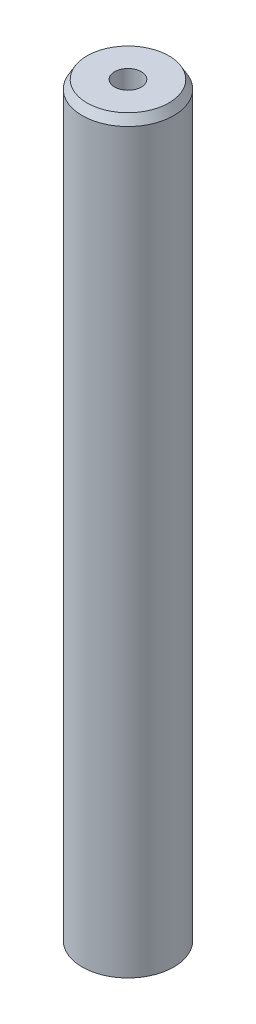
ISO-10303-21;
HEADER;
FILE_DESCRIPTION(('STEP AP214'),'2;1');
FILE_NAME('part.step','',(''),(''),'','','');
FILE_SCHEMA(('AUTOMOTIVE_DESIGN { 1 0 10303 214 1 1 1 1 }'));
ENDSEC;
DATA;
#1=APPLICATION_CONTEXT('core data for automotive mechanical design processes');
#2=APPLICATION_PROTOCOL_DEFINITION('international standard','automotive_design',2000,#1);
#3=PRODUCT_CONTEXT('',#1,'mechanical');
#4=PRODUCT('Part','Part','',(#3));
#5=PRODUCT_RELATED_PRODUCT_CATEGORY('part','',(#4));
#6=PRODUCT_DEFINITION_FORMATION('','',#4);
#7=PRODUCT_DEFINITION_CONTEXT('part definition',#1,'design');
#8=PRODUCT_DEFINITION('design','',#6,#7);
#9=PRODUCT_DEFINITION_SHAPE('','',#8);
#10=(LENGTH_UNIT() NAMED_UNIT(*) SI_UNIT(.MILLI.,.METRE.));
#11=(NAMED_UNIT(*) PLANE_ANGLE_UNIT() SI_UNIT($,.RADIAN.));
#12=(NAMED_UNIT(*) SI_UNIT($,.STERADIAN.) SOLID_ANGLE_UNIT());
#13=UNCERTAINTY_MEASURE_WITH_UNIT(LENGTH_MEASURE(1.E-05),#10,'distance_accuracy_value','');
#14=(GEOMETRIC_REPRESENTATION_CONTEXT(3) GLOBAL_UNCERTAINTY_ASSIGNED_CONTEXT((#13)) GLOBAL_UNIT_ASSIGNED_CONTEXT((#10,
#11,#12)) REPRESENTATION_CONTEXT('',''));
#15=CARTESIAN_POINT('',(0.,0.,0.));
#16=DIRECTION('',(0.,0.,1.));
#17=DIRECTION('',(1.,0.,0.));
#18=AXIS2_PLACEMENT_3D('',#15,#16,#17);
#19=CARTESIAN_POINT('',(0.,204.938461608074,0.));
#20=DIRECTION('',(0.,-1.,0.));
#21=DIRECTION('',(0.,0.,-1.));
#22=AXIS2_PLACEMENT_3D('',#19,#20,#21);
#23=CYLINDRICAL_SURFACE('',#22,12.5);
#24=CARTESIAN_POINT('',(0.,202.617926311817,0.));
#25=DIRECTION('',(0.,1.,0.));
#26=DIRECTION('',(0.,0.,1.));
#27=AXIS2_PLACEMENT_3D('',#24,#25,#26);
#28=CIRCLE('',#27,12.5);
#29=CARTESIAN_POINT('',(0.,202.617926311817,12.5));
#30=VERTEX_POINT('',#29);
#31=EDGE_CURVE('E50',#30,#30,#28,.F.);
#32=ORIENTED_EDGE('',*,*,#31,.T.);
#33=EDGE_LOOP('',(#32));
#34=FACE_BOUND('',#33,.T.);
#35=CARTESIAN_POINT('',(0.,1.33976167795832,0.));
#36=DIRECTION('',(0.,1.,0.));
#37=DIRECTION('',(0.,0.,1.));
#38=AXIS2_PLACEMENT_3D('',#35,#36,#37);
#39=CIRCLE('',#38,12.5);
#40=CARTESIAN_POINT('',(0.,1.33976167795832,12.5));
#41=VERTEX_POINT('',#40);
#42=EDGE_CURVE('E51',#41,#41,#39,.T.);
#43=ORIENTED_EDGE('',*,*,#42,.T.);
#44=EDGE_LOOP('',(#43));
#45=FACE_BOUND('',#44,.T.);
#46=ADVANCED_FACE('F39',(#34,#45),#23,.T.);
#47=CARTESIAN_POINT('',(0.,204.938461608074,0.));
#48=DIRECTION('',(0.,1.,0.));
#49=DIRECTION('',(0.,0.,1.));
#50=AXIS2_PLACEMENT_3D('',#47,#48,#49);
#51=PLANE('',#50);
#52=CARTESIAN_POINT('',(0.,204.938461608074,0.));
#53=DIRECTION('',(0.,1.,0.));
#54=DIRECTION('',(0.,0.,1.));
#55=AXIS2_PLACEMENT_3D('',#52,#53,#54);
#56=CIRCLE('',#55,11.1602383220417);
#57=CARTESIAN_POINT('',(0.,204.938461608074,11.1602383220417));
#58=VERTEX_POINT('',#57);
#59=EDGE_CURVE('E54',#58,#58,#56,.T.);
#60=ORIENTED_EDGE('',*,*,#59,.T.);
#61=EDGE_LOOP('',(#60));
#62=FACE_BOUND('',#61,.T.);
#63=CARTESIAN_POINT('',(0.,204.938461608074,0.));
#64=DIRECTION('',(0.,1.,0.));
#65=DIRECTION('',(0.,0.,1.));
#66=AXIS2_PLACEMENT_3D('',#63,#64,#65);
#67=CIRCLE('',#66,3.63973237438858);
#68=CARTESIAN_POINT('',(0.,204.938461608074,3.63973237438858));
#69=VERTEX_POINT('',#68);
#70=EDGE_CURVE('E58',#69,#69,#67,.T.);
#71=ORIENTED_EDGE('',*,*,#70,.F.);
#72=EDGE_LOOP('',(#71));
#73=FACE_BOUND('',#72,.T.);
#74=ADVANCED_FACE('F69',(#62,#73),#51,.T.);
#75=CARTESIAN_POINT('',(0.,0.,0.));
#76=DIRECTION('',(0.,1.,0.));
#77=DIRECTION('',(0.,0.,1.));
#78=AXIS2_PLACEMENT_3D('',#75,#76,#77);
#79=PLANE('',#78);
#80=CARTESIAN_POINT('',(0.,0.,0.));
#81=DIRECTION('',(0.,1.,0.));
#82=DIRECTION('',(0.,0.,1.));
#83=AXIS2_PLACEMENT_3D('',#80,#81,#82);
#84=CIRCLE('',#83,10.1794647037425);
#85=CARTESIAN_POINT('',(0.,0.,10.1794647037425));
#86=VERTEX_POINT('',#85);
#87=EDGE_CURVE('E10',#86,#86,#84,.F.);
#88=ORIENTED_EDGE('',*,*,#87,.T.);
#89=EDGE_LOOP('',(#88));
#90=FACE_BOUND('',#89,.T.);
#91=CARTESIAN_POINT('',(0.,0.,0.));
#92=DIRECTION('',(0.,1.,0.));
#93=DIRECTION('',(0.,0.,1.));
#94=AXIS2_PLACEMENT_3D('',#91,#92,#93);
#95=CIRCLE('',#94,3.63973237438858);
#96=CARTESIAN_POINT('',(0.,0.,3.63973237438858));
#97=VERTEX_POINT('',#96);
#98=EDGE_CURVE('E63',#97,#97,#95,.T.);
#99=ORIENTED_EDGE('',*,*,#98,.T.);
#100=EDGE_LOOP('',(#99));
#101=FACE_BOUND('',#100,.T.);
#102=ADVANCED_FACE('F75',(#90,#101),#79,.F.);
#103=CARTESIAN_POINT('',(0.,204.938461608074,0.));
#104=DIRECTION('',(0.,-1.,0.));
#105=DIRECTION('',(0.,0.,-1.));
#106=AXIS2_PLACEMENT_3D('',#103,#104,#105);
#107=CYLINDRICAL_SURFACE('',#106,3.63973237438858);
#108=ORIENTED_EDGE('',*,*,#70,.T.);
#109=EDGE_LOOP('',(#108));
#110=FACE_BOUND('',#109,.T.);
#111=ORIENTED_EDGE('',*,*,#98,.F.);
#112=EDGE_LOOP('',(#111));
#113=FACE_BOUND('',#112,.T.);
#114=ADVANCED_FACE('F70',(#110,#113),#107,.F.);
#115=CARTESIAN_POINT('',(0.,204.938461608074,0.));
#116=DIRECTION('',(0.,-1.,0.));
#117=DIRECTION('',(0.,0.,-1.));
#118=AXIS2_PLACEMENT_3D('',#115,#116,#117);
#119=CONICAL_SURFACE('',#118,11.1602383220417,0.523598775598295);
#120=ORIENTED_EDGE('',*,*,#31,.F.);
#121=EDGE_LOOP('',(#120));
#122=FACE_BOUND('',#121,.T.);
#123=ORIENTED_EDGE('',*,*,#59,.F.);
#124=EDGE_LOOP('',(#123));
#125=FACE_BOUND('',#124,.T.);
#126=ADVANCED_FACE('F81',(#122,#125),#119,.T.);
#127=CARTESIAN_POINT('',(0.,1.33976167795832,0.));
#128=DIRECTION('',(0.,1.,0.));
#129=DIRECTION('',(0.,0.,1.));
#130=AXIS2_PLACEMENT_3D('',#127,#128,#129);
#131=CONICAL_SURFACE('',#130,12.5,1.0471975511966);
#132=CARTESIAN_POINT('',(0.,0.,10.1794647037425));
#133=CARTESIAN_POINT('',(0.,0.0139558508120657,10.2036369464118));
#134=CARTESIAN_POINT('',(0.,0.0279117016241315,10.2278091890812));
#135=CARTESIAN_POINT('',(0.,0.0558234032482632,10.2761536744198));
#136=CARTESIAN_POINT('',(0.,0.0697792540603291,10.3003259170892));
#137=CARTESIAN_POINT('',(0.,0.0976909556844609,10.3486704024279));
#138=CARTESIAN_POINT('',(0.,0.111646806496527,10.3728426450972));
#139=CARTESIAN_POINT('',(0.,0.139558508120659,10.4211871304359));
#140=CARTESIAN_POINT('',(0.,0.153514358932724,10.4453593731053));
#141=CARTESIAN_POINT('',(0.,0.181426060556856,10.493703858444));
#142=CARTESIAN_POINT('',(0.,0.195381911368922,10.5178761011133));
#143=CARTESIAN_POINT('',(0.,0.223293612993054,10.566220586452));
#144=CARTESIAN_POINT('',(0.,0.23724946380512,10.5903928291214));
#145=CARTESIAN_POINT('',(0.,0.265161165429251,10.6387373144601));
#146=CARTESIAN_POINT('',(0.,0.279117016241317,10.6629095571294));
#147=CARTESIAN_POINT('',(0.,0.307028717865449,10.7112540424681));
#148=CARTESIAN_POINT('',(0.,0.320984568677515,10.7354262851375));
#149=CARTESIAN_POINT('',(0.,0.348896270301647,10.7837707704762));
#150=CARTESIAN_POINT('',(0.,0.362852121113713,10.8079430131455));
#151=CARTESIAN_POINT('',(0.,0.390763822737844,10.8562874984842));
#152=CARTESIAN_POINT('',(0.,0.40471967354991,10.8804597411536));
#153=CARTESIAN_POINT('',(0.,0.432631375174042,10.9288042264923));
#154=CARTESIAN_POINT('',(0.,0.446587225986108,10.9529764691616));
#155=CARTESIAN_POINT('',(0.,0.474498927610239,11.0013209545003));
#156=CARTESIAN_POINT('',(0.,0.488454778422305,11.0254931971697));
#157=CARTESIAN_POINT('',(0.,0.516366480046437,11.0738376825084));
#158=CARTESIAN_POINT('',(0.,0.530322330858503,11.0980099251777));
#159=CARTESIAN_POINT('',(0.,0.558234032482635,11.1463544105164));
#160=CARTESIAN_POINT('',(0.,0.5721898832947,11.1705266531858));
#161=CARTESIAN_POINT('',(0.,0.600101584918832,11.2188711385245));
#162=CARTESIAN_POINT('',(0.,0.614057435730898,11.2430433811938));
#163=CARTESIAN_POINT('',(0.,0.64196913735503,11.2913878665325));
#164=CARTESIAN_POINT('',(0.,0.655924988167096,11.3155601092019));
#165=CARTESIAN_POINT('',(0.,0.683836689791227,11.3639045945406));
#166=CARTESIAN_POINT('',(0.,0.697792540603293,11.3880768372099));
#167=CARTESIAN_POINT('',(0.,0.725704242227425,11.4364213225486));
#168=CARTESIAN_POINT('',(0.,0.739660093039491,11.460593565218));
#169=CARTESIAN_POINT('',(0.,0.767571794663623,11.5089380505567));
#170=CARTESIAN_POINT('',(0.,0.781527645475688,11.533110293226));
#171=CARTESIAN_POINT('',(0.,0.80943934709982,11.5814547785647));
#172=CARTESIAN_POINT('',(0.,0.823395197911886,11.6056270212341));
#173=CARTESIAN_POINT('',(0.,0.851306899536018,11.6539715065728));
#174=CARTESIAN_POINT('',(0.,0.865262750348084,11.6781437492421));
#175=CARTESIAN_POINT('',(0.,0.893174451972216,11.7264882345808));
#176=CARTESIAN_POINT('',(0.,0.907130302784281,11.7506604772502));
#177=CARTESIAN_POINT('',(0.,0.935042004408413,11.7990049625889));
#178=CARTESIAN_POINT('',(0.,0.948997855220479,11.8231772052582));
#179=CARTESIAN_POINT('',(0.,0.976909556844611,11.8715216905969));
#180=CARTESIAN_POINT('',(0.,0.990865407656677,11.8956939332663));
#181=CARTESIAN_POINT('',(0.,1.01877710928081,11.944038418605));
#182=CARTESIAN_POINT('',(0.,1.03273296009287,11.9682106612743));
#183=CARTESIAN_POINT('',(0.,1.06064466171701,12.016555146613));
#184=CARTESIAN_POINT('',(0.,1.07460051252907,12.0407273892824));
#185=CARTESIAN_POINT('',(0.,1.1025122141532,12.0890718746211));
#186=CARTESIAN_POINT('',(0.,1.11646806496527,12.1132441172904));
#187=CARTESIAN_POINT('',(0.,1.1443797665894,12.1615886026291));
#188=CARTESIAN_POINT('',(0.,1.15833561740147,12.1857608452985));
#189=CARTESIAN_POINT('',(0.,1.1862473190256,12.2341053306372));
#190=CARTESIAN_POINT('',(0.,1.20020316983766,12.2582775733065));
#191=CARTESIAN_POINT('',(0.,1.2281148714618,12.3066220586452));
#192=CARTESIAN_POINT('',(0.,1.24207072227386,12.3307943013146));
#193=CARTESIAN_POINT('',(0.,1.26998242389799,12.3791387866533));
#194=CARTESIAN_POINT('',(0.,1.28393827471006,12.4033110293226));
#195=CARTESIAN_POINT('',(0.,1.31184997633419,12.4516555146613));
#196=CARTESIAN_POINT('',(0.,1.32580582714626,12.4758277573307));
#197=CARTESIAN_POINT('',(0.,1.33976167795832,12.5));
#198=B_SPLINE_CURVE_WITH_KNOTS('',3,(#132,#133,#134,#135,#136,#137,#138,#139,#140,#141,#142,
#143,#144,#145,#146,#147,#148,#149,#150,#151,#152,#153,#154,#155,#156,#157,#158,#159,#160,#161,
#162,#163,#164,#165,#166,#167,#168,#169,#170,#171,#172,#173,#174,#175,#176,#177,#178,#179,#180,
#181,#182,#183,#184,#185,#186,#187,#188,#189,#190,#191,#192,#193,#194,#195,#196,#197),
.UNSPECIFIED.,.F.,.F.,(4,2,2,2,2,2,2,2,2,2,2,2,2,2,2,2,2,2,2,2,2,2,2,2,2,2,2,2,2,2,2,2,4),(0.,
0.0837351048723947,0.167470209744789,0.251205314617184,0.33494041948958,0.418675524361975,
0.50241062923437,0.586145734106766,0.669880838979161,0.753615943851556,0.837351048723952,
0.921086153596347,1.00482125846874,1.08855636334114,1.17229146821353,1.25602657308593,
1.33976167795832,1.42349678283072,1.50723188770311,1.59096699257551,1.6747020974479,
1.7584372023203,1.8421723071927,1.92590741206509,2.00964251693749,2.09337762180988,
2.17711272668228,2.26084783155467,2.34458293642707,2.42831804129946,2.51205314617186,
2.59578825104425,2.67952335591665),.UNSPECIFIED.);
#199=EDGE_CURVE('BSEAM45',#86,#41,#198,.T.);
#200=ORIENTED_EDGE('',*,*,#87,.F.);
#201=ORIENTED_EDGE('',*,*,#42,.F.);
#202=ORIENTED_EDGE('',*,*,#199,.T.);
#203=ORIENTED_EDGE('',*,*,#199,.F.);
#204=EDGE_LOOP('',(#200,#202,#201,#203));
#205=FACE_BOUND('',#204,.T.);
#206=ADVANCED_FACE('F45',(#205),#131,.T.);
#207=CLOSED_SHELL('',(#46,#74,#102,#114,#126,#206));
#208=MANIFOLD_SOLID_BREP('B2',#207);
#209=ADVANCED_BREP_SHAPE_REPRESENTATION('',(#18,#208),#14);
#210=SHAPE_DEFINITION_REPRESENTATION(#9,#209);
ENDSEC;
END-ISO-10303-21;
